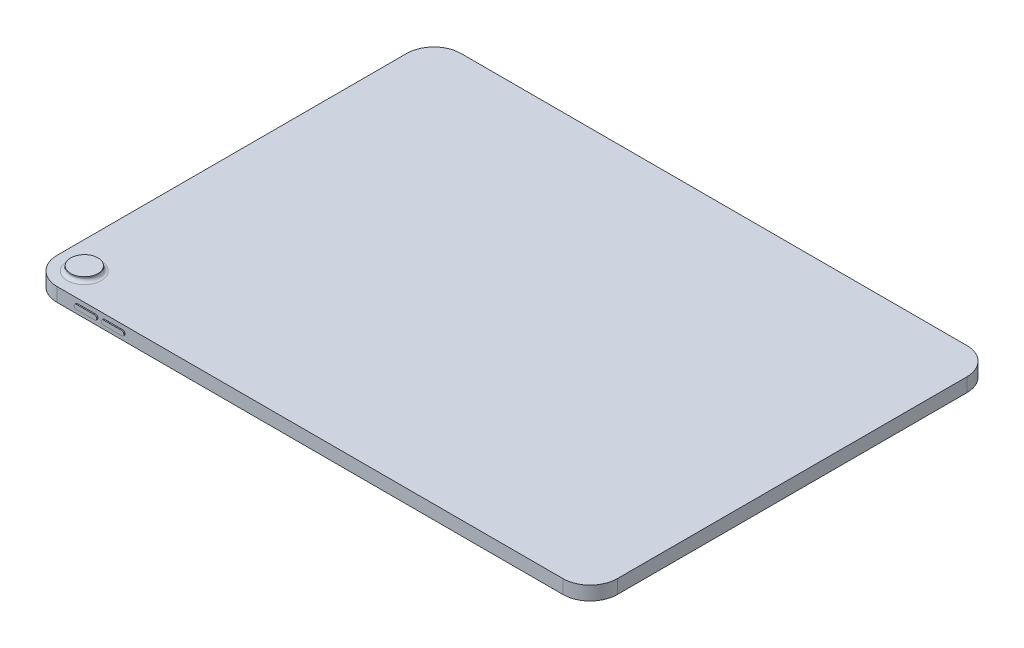
ISO-10303-21;
HEADER;
FILE_DESCRIPTION(('STEP AP214'),'2;1');
FILE_NAME('part.step','',(''),(''),'','','');
FILE_SCHEMA(('AUTOMOTIVE_DESIGN { 1 0 10303 214 1 1 1 1 }'));
ENDSEC;
DATA;
#1=APPLICATION_CONTEXT('core data for automotive mechanical design processes');
#2=APPLICATION_PROTOCOL_DEFINITION('international standard','automotive_design',2000,#1);
#3=PRODUCT_CONTEXT('',#1,'mechanical');
#4=PRODUCT('Part','Part','',(#3));
#5=PRODUCT_RELATED_PRODUCT_CATEGORY('part','',(#4));
#6=PRODUCT_DEFINITION_FORMATION('','',#4);
#7=PRODUCT_DEFINITION_CONTEXT('part definition',#1,'design');
#8=PRODUCT_DEFINITION('design','',#6,#7);
#9=PRODUCT_DEFINITION_SHAPE('','',#8);
#10=(LENGTH_UNIT() NAMED_UNIT(*) SI_UNIT(.MILLI.,.METRE.));
#11=(NAMED_UNIT(*) PLANE_ANGLE_UNIT() SI_UNIT($,.RADIAN.));
#12=(NAMED_UNIT(*) SI_UNIT($,.STERADIAN.) SOLID_ANGLE_UNIT());
#13=UNCERTAINTY_MEASURE_WITH_UNIT(LENGTH_MEASURE(1.E-05),#10,'distance_accuracy_value','');
#14=(GEOMETRIC_REPRESENTATION_CONTEXT(3) GLOBAL_UNCERTAINTY_ASSIGNED_CONTEXT((#13)) GLOBAL_UNIT_ASSIGNED_CONTEXT((#10,
#11,#12)) REPRESENTATION_CONTEXT('',''));
#15=CARTESIAN_POINT('',(0.,0.,0.));
#16=DIRECTION('',(0.,0.,1.));
#17=DIRECTION('',(1.,0.,0.));
#18=AXIS2_PLACEMENT_3D('',#15,#16,#17);
#19=CARTESIAN_POINT('',(-123.8,6.1,89.25));
#20=DIRECTION('',(0.,0.,-1.));
#21=DIRECTION('',(-1.,0.,0.));
#22=AXIS2_PLACEMENT_3D('',#19,#20,#21);
#23=PLANE('',#22);
#24=CARTESIAN_POINT('',(-82.8000000000001,3.05,89.25));
#25=DIRECTION('',(0.,0.,1.));
#26=DIRECTION('',(1.,0.,0.));
#27=AXIS2_PLACEMENT_3D('',#24,#25,#26);
#28=CIRCLE('',#27,1.);
#29=CARTESIAN_POINT('',(-82.8000000000001,2.05,89.25));
#30=VERTEX_POINT('',#29);
#31=CARTESIAN_POINT('',(-82.8000000000001,4.05,89.25));
#32=VERTEX_POINT('',#31);
#33=EDGE_CURVE('E196',#30,#32,#28,.T.);
#34=ORIENTED_EDGE('',*,*,#33,.F.);
#35=DIRECTION('',(1.,0.,0.));
#36=VECTOR('',#35,1.);
#37=CARTESIAN_POINT('',(-90.8000000000004,2.05,89.25));
#38=LINE('',#37,#36);
#39=CARTESIAN_POINT('',(-90.8000000000004,2.05,89.25));
#40=VERTEX_POINT('',#39);
#41=EDGE_CURVE('E209',#40,#30,#38,.T.);
#42=ORIENTED_EDGE('',*,*,#41,.F.);
#43=CARTESIAN_POINT('',(-90.8000000000004,3.05,89.25));
#44=DIRECTION('',(0.,0.,1.));
#45=DIRECTION('',(1.,0.,0.));
#46=AXIS2_PLACEMENT_3D('',#43,#44,#45);
#47=CIRCLE('',#46,1.);
#48=CARTESIAN_POINT('',(-90.8000000000004,4.05,89.25));
#49=VERTEX_POINT('',#48);
#50=EDGE_CURVE('E218',#49,#40,#47,.T.);
#51=ORIENTED_EDGE('',*,*,#50,.F.);
#52=DIRECTION('',(-1.,0.,0.));
#53=VECTOR('',#52,1.);
#54=CARTESIAN_POINT('',(-90.8000000000004,4.05,89.25));
#55=LINE('',#54,#53);
#56=EDGE_CURVE('E199',#32,#49,#55,.T.);
#57=ORIENTED_EDGE('',*,*,#56,.F.);
#58=EDGE_LOOP('',(#34,#42,#51,#57));
#59=FACE_BOUND('',#58,.T.);
#60=DIRECTION('',(1.,0.,0.));
#61=VECTOR('',#60,1.);
#62=CARTESIAN_POINT('',(-123.8,6.1,89.25));
#63=LINE('',#62,#61);
#64=CARTESIAN_POINT('',(-111.8,6.1,89.25));
#65=VERTEX_POINT('',#64);
#66=CARTESIAN_POINT('',(111.8,6.1,89.25));
#67=VERTEX_POINT('',#66);
#68=EDGE_CURVE('E271',#65,#67,#63,.T.);
#69=ORIENTED_EDGE('',*,*,#68,.F.);
#70=DIRECTION('',(0.,-1.,0.));
#71=VECTOR('',#70,1.);
#72=CARTESIAN_POINT('',(-111.8,6.1,89.25));
#73=LINE('',#72,#71);
#74=CARTESIAN_POINT('',(-111.8,0.,89.25));
#75=VERTEX_POINT('',#74);
#76=EDGE_CURVE('E321',#65,#75,#73,.T.);
#77=ORIENTED_EDGE('',*,*,#76,.T.);
#78=DIRECTION('',(1.,0.,0.));
#79=VECTOR('',#78,1.);
#80=CARTESIAN_POINT('',(-123.8,0.,89.25));
#81=LINE('',#80,#79);
#82=CARTESIAN_POINT('',(111.8,0.,89.25));
#83=VERTEX_POINT('',#82);
#84=EDGE_CURVE('E285',#75,#83,#81,.T.);
#85=ORIENTED_EDGE('',*,*,#84,.T.);
#86=DIRECTION('',(0.,-1.,0.));
#87=VECTOR('',#86,1.);
#88=CARTESIAN_POINT('',(111.8,6.1,89.25));
#89=LINE('',#88,#87);
#90=EDGE_CURVE('E319',#83,#67,#89,.F.);
#91=ORIENTED_EDGE('',*,*,#90,.T.);
#92=EDGE_LOOP('',(#69,#77,#85,#91));
#93=FACE_BOUND('',#92,.T.);
#94=CARTESIAN_POINT('',(-94.7999999999996,3.05,89.25));
#95=DIRECTION('',(0.,0.,1.));
#96=DIRECTION('',(1.,0.,0.));
#97=AXIS2_PLACEMENT_3D('',#94,#95,#96);
#98=CIRCLE('',#97,1.);
#99=CARTESIAN_POINT('',(-94.7999999999996,2.05,89.25));
#100=VERTEX_POINT('',#99);
#101=CARTESIAN_POINT('',(-94.7999999999996,4.05,89.25));
#102=VERTEX_POINT('',#101);
#103=EDGE_CURVE('E195',#100,#102,#98,.T.);
#104=ORIENTED_EDGE('',*,*,#103,.F.);
#105=DIRECTION('',(1.,0.,0.));
#106=VECTOR('',#105,1.);
#107=CARTESIAN_POINT('',(-102.8,2.05,89.25));
#108=LINE('',#107,#106);
#109=CARTESIAN_POINT('',(-102.8,2.05,89.25));
#110=VERTEX_POINT('',#109);
#111=EDGE_CURVE('E192',#110,#100,#108,.T.);
#112=ORIENTED_EDGE('',*,*,#111,.F.);
#113=CARTESIAN_POINT('',(-102.8,3.05,89.25));
#114=DIRECTION('',(0.,0.,1.));
#115=DIRECTION('',(1.,0.,0.));
#116=AXIS2_PLACEMENT_3D('',#113,#114,#115);
#117=CIRCLE('',#116,1.);
#118=CARTESIAN_POINT('',(-102.8,4.05,89.25));
#119=VERTEX_POINT('',#118);
#120=EDGE_CURVE('E58',#119,#110,#117,.T.);
#121=ORIENTED_EDGE('',*,*,#120,.F.);
#122=DIRECTION('',(-1.,0.,0.));
#123=VECTOR('',#122,1.);
#124=CARTESIAN_POINT('',(-102.8,4.05,89.25));
#125=LINE('',#124,#123);
#126=EDGE_CURVE('E53',#102,#119,#125,.T.);
#127=ORIENTED_EDGE('',*,*,#126,.F.);
#128=EDGE_LOOP('',(#104,#112,#121,#127));
#129=FACE_BOUND('',#128,.T.);
#130=ADVANCED_FACE('F38',(#59,#93,#129),#23,.F.);
#131=CARTESIAN_POINT('',(-123.8,6.1,-89.25));
#132=DIRECTION('',(1.,0.,0.));
#133=DIRECTION('',(0.,0.,-1.));
#134=AXIS2_PLACEMENT_3D('',#131,#132,#133);
#135=PLANE('',#134);
#136=DIRECTION('',(0.,0.,1.));
#137=VECTOR('',#136,1.);
#138=CARTESIAN_POINT('',(-123.8,6.1,-89.25));
#139=LINE('',#138,#137);
#140=CARTESIAN_POINT('',(-123.8,6.1,-77.25));
#141=VERTEX_POINT('',#140);
#142=CARTESIAN_POINT('',(-123.8,6.1,77.25));
#143=VERTEX_POINT('',#142);
#144=EDGE_CURVE('E268',#141,#143,#139,.T.);
#145=ORIENTED_EDGE('',*,*,#144,.F.);
#146=DIRECTION('',(0.,-1.,0.));
#147=VECTOR('',#146,1.);
#148=CARTESIAN_POINT('',(-123.8,6.1,-77.25));
#149=LINE('',#148,#147);
#150=CARTESIAN_POINT('',(-123.8,0.,-77.25));
#151=VERTEX_POINT('',#150);
#152=EDGE_CURVE('E295',#141,#151,#149,.T.);
#153=ORIENTED_EDGE('',*,*,#152,.T.);
#154=DIRECTION('',(0.,0.,1.));
#155=VECTOR('',#154,1.);
#156=CARTESIAN_POINT('',(-123.8,0.,-89.25));
#157=LINE('',#156,#155);
#158=CARTESIAN_POINT('',(-123.8,0.,77.25));
#159=VERTEX_POINT('',#158);
#160=EDGE_CURVE('E267',#151,#159,#157,.T.);
#161=ORIENTED_EDGE('',*,*,#160,.T.);
#162=DIRECTION('',(0.,-1.,0.));
#163=VECTOR('',#162,1.);
#164=CARTESIAN_POINT('',(-123.8,6.1,77.25));
#165=LINE('',#164,#163);
#166=EDGE_CURVE('E282',#159,#143,#165,.F.);
#167=ORIENTED_EDGE('',*,*,#166,.T.);
#168=EDGE_LOOP('',(#145,#153,#161,#167));
#169=FACE_BOUND('',#168,.T.);
#170=CARTESIAN_POINT('',(-123.8,3.05,74.4));
#171=DIRECTION('',(-1.,0.,0.));
#172=DIRECTION('',(0.,0.,1.));
#173=AXIS2_PLACEMENT_3D('',#170,#171,#172);
#174=CIRCLE('',#173,1.85);
#175=CARTESIAN_POINT('',(-123.8,1.2,74.4));
#176=VERTEX_POINT('',#175);
#177=CARTESIAN_POINT('',(-123.8,4.9,74.4));
#178=VERTEX_POINT('',#177);
#179=EDGE_CURVE('E234',#176,#178,#174,.T.);
#180=ORIENTED_EDGE('',*,*,#179,.F.);
#181=DIRECTION('',(0.,0.,-1.));
#182=VECTOR('',#181,1.);
#183=CARTESIAN_POINT('',(-123.8,1.2,74.4));
#184=LINE('',#183,#182);
#185=CARTESIAN_POINT('',(-123.8,1.2,61.1));
#186=VERTEX_POINT('',#185);
#187=EDGE_CURVE('E239',#176,#186,#184,.T.);
#188=ORIENTED_EDGE('',*,*,#187,.T.);
#189=CARTESIAN_POINT('',(-123.8,3.05,61.1));
#190=DIRECTION('',(-1.,0.,0.));
#191=DIRECTION('',(0.,0.,1.));
#192=AXIS2_PLACEMENT_3D('',#189,#190,#191);
#193=CIRCLE('',#192,1.85);
#194=CARTESIAN_POINT('',(-123.8,4.9,61.1));
#195=VERTEX_POINT('',#194);
#196=EDGE_CURVE('E251',#195,#186,#193,.T.);
#197=ORIENTED_EDGE('',*,*,#196,.F.);
#198=DIRECTION('',(0.,0.,-1.));
#199=VECTOR('',#198,1.);
#200=CARTESIAN_POINT('',(-123.8,4.9,74.4));
#201=LINE('',#200,#199);
#202=EDGE_CURVE('E249',#178,#195,#201,.T.);
#203=ORIENTED_EDGE('',*,*,#202,.F.);
#204=EDGE_LOOP('',(#180,#188,#197,#203));
#205=FACE_BOUND('',#204,.T.);
#206=ADVANCED_FACE('F349',(#169,#205),#135,.F.);
#207=CARTESIAN_POINT('',(123.8,6.1,-89.25));
#208=DIRECTION('',(-1.,0.,0.));
#209=DIRECTION('',(0.,0.,1.));
#210=AXIS2_PLACEMENT_3D('',#207,#208,#209);
#211=PLANE('',#210);
#212=DIRECTION('',(0.,0.,-1.));
#213=VECTOR('',#212,1.);
#214=CARTESIAN_POINT('',(123.8,0.,-89.25));
#215=LINE('',#214,#213);
#216=CARTESIAN_POINT('',(123.8,0.,77.25));
#217=VERTEX_POINT('',#216);
#218=CARTESIAN_POINT('',(123.8,0.,-77.25));
#219=VERTEX_POINT('',#218);
#220=EDGE_CURVE('E288',#217,#219,#215,.T.);
#221=ORIENTED_EDGE('',*,*,#220,.T.);
#222=DIRECTION('',(0.,-1.,0.));
#223=VECTOR('',#222,1.);
#224=CARTESIAN_POINT('',(123.8,6.1,-77.25));
#225=LINE('',#224,#223);
#226=CARTESIAN_POINT('',(123.8,6.1,-77.25));
#227=VERTEX_POINT('',#226);
#228=EDGE_CURVE('E327',#219,#227,#225,.F.);
#229=ORIENTED_EDGE('',*,*,#228,.T.);
#230=DIRECTION('',(0.,0.,-1.));
#231=VECTOR('',#230,1.);
#232=CARTESIAN_POINT('',(123.8,6.1,-89.25));
#233=LINE('',#232,#231);
#234=CARTESIAN_POINT('',(123.8,6.1,77.25));
#235=VERTEX_POINT('',#234);
#236=EDGE_CURVE('E275',#235,#227,#233,.T.);
#237=ORIENTED_EDGE('',*,*,#236,.F.);
#238=DIRECTION('',(0.,-1.,0.));
#239=VECTOR('',#238,1.);
#240=CARTESIAN_POINT('',(123.8,6.1,77.25));
#241=LINE('',#240,#239);
#242=EDGE_CURVE('E324',#235,#217,#241,.T.);
#243=ORIENTED_EDGE('',*,*,#242,.T.);
#244=EDGE_LOOP('',(#221,#229,#237,#243));
#245=FACE_BOUND('',#244,.T.);
#246=ADVANCED_FACE('F355',(#245),#211,.F.);
#247=CARTESIAN_POINT('',(-123.8,6.1,-89.25));
#248=DIRECTION('',(0.,0.,1.));
#249=DIRECTION('',(1.,0.,0.));
#250=AXIS2_PLACEMENT_3D('',#247,#248,#249);
#251=PLANE('',#250);
#252=DIRECTION('',(-1.,0.,0.));
#253=VECTOR('',#252,1.);
#254=CARTESIAN_POINT('',(-123.8,0.,-89.25));
#255=LINE('',#254,#253);
#256=CARTESIAN_POINT('',(111.8,0.,-89.25));
#257=VERTEX_POINT('',#256);
#258=CARTESIAN_POINT('',(-111.8,0.,-89.25));
#259=VERTEX_POINT('',#258);
#260=EDGE_CURVE('E272',#257,#259,#255,.T.);
#261=ORIENTED_EDGE('',*,*,#260,.T.);
#262=DIRECTION('',(0.,-1.,0.));
#263=VECTOR('',#262,1.);
#264=CARTESIAN_POINT('',(-111.8,6.1,-89.25));
#265=LINE('',#264,#263);
#266=CARTESIAN_POINT('',(-111.8,6.1,-89.25));
#267=VERTEX_POINT('',#266);
#268=EDGE_CURVE('E309',#259,#267,#265,.F.);
#269=ORIENTED_EDGE('',*,*,#268,.T.);
#270=DIRECTION('',(-1.,0.,0.));
#271=VECTOR('',#270,1.);
#272=CARTESIAN_POINT('',(-123.8,6.1,-89.25));
#273=LINE('',#272,#271);
#274=CARTESIAN_POINT('',(111.8,6.1,-89.25));
#275=VERTEX_POINT('',#274);
#276=EDGE_CURVE('E279',#275,#267,#273,.T.);
#277=ORIENTED_EDGE('',*,*,#276,.F.);
#278=DIRECTION('',(0.,-1.,0.));
#279=VECTOR('',#278,1.);
#280=CARTESIAN_POINT('',(111.8,6.1,-89.25));
#281=LINE('',#280,#279);
#282=EDGE_CURVE('E306',#275,#257,#281,.T.);
#283=ORIENTED_EDGE('',*,*,#282,.T.);
#284=EDGE_LOOP('',(#261,#269,#277,#283));
#285=FACE_BOUND('',#284,.T.);
#286=ADVANCED_FACE('F396',(#285),#251,.F.);
#287=CARTESIAN_POINT('',(0.,6.1,0.));
#288=DIRECTION('',(0.,1.,0.));
#289=DIRECTION('',(0.,0.,1.));
#290=AXIS2_PLACEMENT_3D('',#287,#288,#289);
#291=PLANE('',#290);
#292=CARTESIAN_POINT('',(-111.8,6.1,77.25));
#293=DIRECTION('',(0.,1.,0.));
#294=DIRECTION('',(0.,0.,1.));
#295=AXIS2_PLACEMENT_3D('',#292,#293,#294);
#296=CIRCLE('',#295,7.5);
#297=CARTESIAN_POINT('',(-111.8,6.1,84.75));
#298=VERTEX_POINT('',#297);
#299=EDGE_CURVE('E11',#298,#298,#296,.F.);
#300=ORIENTED_EDGE('',*,*,#299,.T.);
#301=EDGE_LOOP('',(#300));
#302=FACE_BOUND('',#301,.T.);
#303=ORIENTED_EDGE('',*,*,#276,.T.);
#304=CARTESIAN_POINT('',(-111.8,6.1,-77.25));
#305=DIRECTION('',(0.,1.,0.));
#306=DIRECTION('',(0.,0.,1.));
#307=AXIS2_PLACEMENT_3D('',#304,#305,#306);
#308=CIRCLE('',#307,12.);
#309=EDGE_CURVE('E317',#267,#141,#308,.T.);
#310=ORIENTED_EDGE('',*,*,#309,.T.);
#311=ORIENTED_EDGE('',*,*,#144,.T.);
#312=CARTESIAN_POINT('',(-111.8,6.1,77.25));
#313=DIRECTION('',(0.,1.,0.));
#314=DIRECTION('',(0.,0.,1.));
#315=AXIS2_PLACEMENT_3D('',#312,#313,#314);
#316=CIRCLE('',#315,12.);
#317=EDGE_CURVE('E315',#143,#65,#316,.T.);
#318=ORIENTED_EDGE('',*,*,#317,.T.);
#319=ORIENTED_EDGE('',*,*,#68,.T.);
#320=CARTESIAN_POINT('',(111.8,6.1,77.25));
#321=DIRECTION('',(0.,1.,0.));
#322=DIRECTION('',(0.,0.,1.));
#323=AXIS2_PLACEMENT_3D('',#320,#321,#322);
#324=CIRCLE('',#323,12.);
#325=EDGE_CURVE('E311',#67,#235,#324,.T.);
#326=ORIENTED_EDGE('',*,*,#325,.T.);
#327=ORIENTED_EDGE('',*,*,#236,.T.);
#328=CARTESIAN_POINT('',(111.8,6.1,-77.25));
#329=DIRECTION('',(0.,1.,0.));
#330=DIRECTION('',(0.,0.,1.));
#331=AXIS2_PLACEMENT_3D('',#328,#329,#330);
#332=CIRCLE('',#331,12.);
#333=EDGE_CURVE('E313',#227,#275,#332,.T.);
#334=ORIENTED_EDGE('',*,*,#333,.T.);
#335=EDGE_LOOP('',(#303,#310,#311,#318,#319,#326,#327,#334));
#336=FACE_BOUND('',#335,.T.);
#337=ADVANCED_FACE('F386',(#302,#336),#291,.T.);
#338=CARTESIAN_POINT('',(0.,0.,0.));
#339=DIRECTION('',(0.,1.,0.));
#340=DIRECTION('',(0.,0.,1.));
#341=AXIS2_PLACEMENT_3D('',#338,#339,#340);
#342=PLANE('',#341);
#343=ORIENTED_EDGE('',*,*,#160,.F.);
#344=CARTESIAN_POINT('',(-111.8,0.,-77.25));
#345=DIRECTION('',(0.,1.,0.));
#346=DIRECTION('',(0.,0.,1.));
#347=AXIS2_PLACEMENT_3D('',#344,#345,#346);
#348=CIRCLE('',#347,12.);
#349=EDGE_CURVE('E304',#151,#259,#348,.F.);
#350=ORIENTED_EDGE('',*,*,#349,.T.);
#351=ORIENTED_EDGE('',*,*,#260,.F.);
#352=CARTESIAN_POINT('',(111.8,0.,-77.25));
#353=DIRECTION('',(0.,1.,0.));
#354=DIRECTION('',(0.,0.,1.));
#355=AXIS2_PLACEMENT_3D('',#352,#353,#354);
#356=CIRCLE('',#355,12.);
#357=EDGE_CURVE('E300',#257,#219,#356,.F.);
#358=ORIENTED_EDGE('',*,*,#357,.T.);
#359=ORIENTED_EDGE('',*,*,#220,.F.);
#360=CARTESIAN_POINT('',(111.8,0.,77.25));
#361=DIRECTION('',(0.,1.,0.));
#362=DIRECTION('',(0.,0.,1.));
#363=AXIS2_PLACEMENT_3D('',#360,#361,#362);
#364=CIRCLE('',#363,12.);
#365=EDGE_CURVE('E298',#217,#83,#364,.F.);
#366=ORIENTED_EDGE('',*,*,#365,.T.);
#367=ORIENTED_EDGE('',*,*,#84,.F.);
#368=CARTESIAN_POINT('',(-111.8,0.,77.25));
#369=DIRECTION('',(0.,1.,0.));
#370=DIRECTION('',(0.,0.,1.));
#371=AXIS2_PLACEMENT_3D('',#368,#369,#370);
#372=CIRCLE('',#371,12.);
#373=EDGE_CURVE('E302',#75,#159,#372,.F.);
#374=ORIENTED_EDGE('',*,*,#373,.T.);
#375=EDGE_LOOP('',(#343,#350,#351,#358,#359,#366,#367,#374));
#376=FACE_BOUND('',#375,.T.);
#377=ADVANCED_FACE('F366',(#376),#342,.F.);
#378=CARTESIAN_POINT('',(-111.8,6.1,-77.25));
#379=DIRECTION('',(0.,-1.,0.));
#380=DIRECTION('',(0.,0.,-1.));
#381=AXIS2_PLACEMENT_3D('',#378,#379,#380);
#382=CYLINDRICAL_SURFACE('',#381,12.);
#383=ORIENTED_EDGE('',*,*,#309,.F.);
#384=ORIENTED_EDGE('',*,*,#268,.F.);
#385=ORIENTED_EDGE('',*,*,#349,.F.);
#386=ORIENTED_EDGE('',*,*,#152,.F.);
#387=EDGE_LOOP('',(#383,#384,#385,#386));
#388=FACE_BOUND('',#387,.T.);
#389=ADVANCED_FACE('F362',(#388),#382,.T.);
#390=CARTESIAN_POINT('',(-111.8,6.1,77.25));
#391=DIRECTION('',(0.,-1.,0.));
#392=DIRECTION('',(0.,0.,-1.));
#393=AXIS2_PLACEMENT_3D('',#390,#391,#392);
#394=CYLINDRICAL_SURFACE('',#393,12.);
#395=ORIENTED_EDGE('',*,*,#317,.F.);
#396=ORIENTED_EDGE('',*,*,#166,.F.);
#397=ORIENTED_EDGE('',*,*,#373,.F.);
#398=ORIENTED_EDGE('',*,*,#76,.F.);
#399=EDGE_LOOP('',(#395,#396,#397,#398));
#400=FACE_BOUND('',#399,.T.);
#401=ADVANCED_FACE('F365',(#400),#394,.T.);
#402=CARTESIAN_POINT('',(111.8,6.1,-77.25));
#403=DIRECTION('',(0.,-1.,0.));
#404=DIRECTION('',(0.,0.,-1.));
#405=AXIS2_PLACEMENT_3D('',#402,#403,#404);
#406=CYLINDRICAL_SURFACE('',#405,12.);
#407=ORIENTED_EDGE('',*,*,#333,.F.);
#408=ORIENTED_EDGE('',*,*,#228,.F.);
#409=ORIENTED_EDGE('',*,*,#357,.F.);
#410=ORIENTED_EDGE('',*,*,#282,.F.);
#411=EDGE_LOOP('',(#407,#408,#409,#410));
#412=FACE_BOUND('',#411,.T.);
#413=ADVANCED_FACE('F370',(#412),#406,.T.);
#414=CARTESIAN_POINT('',(111.8,6.1,77.25));
#415=DIRECTION('',(0.,-1.,0.));
#416=DIRECTION('',(0.,0.,-1.));
#417=AXIS2_PLACEMENT_3D('',#414,#415,#416);
#418=CYLINDRICAL_SURFACE('',#417,12.);
#419=ORIENTED_EDGE('',*,*,#325,.F.);
#420=ORIENTED_EDGE('',*,*,#90,.F.);
#421=ORIENTED_EDGE('',*,*,#365,.F.);
#422=ORIENTED_EDGE('',*,*,#242,.F.);
#423=EDGE_LOOP('',(#419,#420,#421,#422));
#424=FACE_BOUND('',#423,.T.);
#425=ADVANCED_FACE('F373',(#424),#418,.T.);
#426=CARTESIAN_POINT('',(-111.8,8.1,77.25));
#427=DIRECTION('',(0.,-1.,0.));
#428=DIRECTION('',(0.,0.,-1.));
#429=AXIS2_PLACEMENT_3D('',#426,#427,#428);
#430=CYLINDRICAL_SURFACE('',#429,6.);
#431=CARTESIAN_POINT('',(-111.8,7.6,77.25));
#432=DIRECTION('',(0.,1.,0.));
#433=DIRECTION('',(0.,0.,1.));
#434=AXIS2_PLACEMENT_3D('',#431,#432,#433);
#435=CIRCLE('',#434,6.);
#436=CARTESIAN_POINT('',(-111.8,7.6,83.25));
#437=VERTEX_POINT('',#436);
#438=EDGE_CURVE('E46',#437,#437,#435,.T.);
#439=ORIENTED_EDGE('',*,*,#438,.T.);
#440=EDGE_LOOP('',(#439));
#441=FACE_BOUND('',#440,.T.);
#442=CARTESIAN_POINT('',(-111.8,8.1,77.25));
#443=DIRECTION('',(0.,1.,0.));
#444=DIRECTION('',(0.,0.,1.));
#445=AXIS2_PLACEMENT_3D('',#442,#443,#444);
#446=CIRCLE('',#445,6.);
#447=CARTESIAN_POINT('',(-111.8,8.1,83.25));
#448=VERTEX_POINT('',#447);
#449=EDGE_CURVE('E264',#448,#448,#446,.T.);
#450=ORIENTED_EDGE('',*,*,#449,.F.);
#451=EDGE_LOOP('',(#450));
#452=FACE_BOUND('',#451,.T.);
#453=ADVANCED_FACE('F331',(#441,#452),#430,.T.);
#454=CARTESIAN_POINT('',(-111.8,8.1,77.25));
#455=DIRECTION('',(0.,1.,0.));
#456=DIRECTION('',(0.,0.,1.));
#457=AXIS2_PLACEMENT_3D('',#454,#455,#456);
#458=PLANE('',#457);
#459=ORIENTED_EDGE('',*,*,#449,.T.);
#460=EDGE_LOOP('',(#459));
#461=FACE_BOUND('',#460,.T.);
#462=ADVANCED_FACE('F336',(#461),#458,.T.);
#463=CARTESIAN_POINT('',(-111.8,7.6,77.25));
#464=DIRECTION('',(0.,1.,0.));
#465=DIRECTION('',(0.,0.,1.));
#466=AXIS2_PLACEMENT_3D('',#463,#464,#465);
#467=TOROIDAL_SURFACE('',#466,7.5,1.5);
#468=ORIENTED_EDGE('',*,*,#299,.F.);
#469=EDGE_LOOP('',(#468));
#470=FACE_BOUND('',#469,.T.);
#471=ORIENTED_EDGE('',*,*,#438,.F.);
#472=EDGE_LOOP('',(#471));
#473=FACE_BOUND('',#472,.T.);
#474=ADVANCED_FACE('F40',(#470,#473),#467,.F.);
#475=CARTESIAN_POINT('',(-124.3,3.05,74.4));
#476=DIRECTION('',(1.,0.,0.));
#477=DIRECTION('',(0.,0.,-1.));
#478=AXIS2_PLACEMENT_3D('',#475,#476,#477);
#479=CYLINDRICAL_SURFACE('',#478,1.85);
#480=ORIENTED_EDGE('',*,*,#179,.T.);
#481=DIRECTION('',(1.,0.,0.));
#482=VECTOR('',#481,1.);
#483=CARTESIAN_POINT('',(-124.3,4.9,74.4));
#484=LINE('',#483,#482);
#485=CARTESIAN_POINT('',(-124.3,4.9,74.4));
#486=VERTEX_POINT('',#485);
#487=EDGE_CURVE('E262',#486,#178,#484,.T.);
#488=ORIENTED_EDGE('',*,*,#487,.F.);
#489=CARTESIAN_POINT('',(-124.3,3.05,74.4));
#490=DIRECTION('',(-1.,0.,0.));
#491=DIRECTION('',(0.,0.,1.));
#492=AXIS2_PLACEMENT_3D('',#489,#490,#491);
#493=CIRCLE('',#492,1.85);
#494=CARTESIAN_POINT('',(-124.3,1.2,74.4));
#495=VERTEX_POINT('',#494);
#496=EDGE_CURVE('E235',#495,#486,#493,.T.);
#497=ORIENTED_EDGE('',*,*,#496,.F.);
#498=DIRECTION('',(1.,0.,0.));
#499=VECTOR('',#498,1.);
#500=CARTESIAN_POINT('',(-124.3,1.2,74.4));
#501=LINE('',#500,#499);
#502=EDGE_CURVE('E246',#495,#176,#501,.T.);
#503=ORIENTED_EDGE('',*,*,#502,.T.);
#504=EDGE_LOOP('',(#480,#488,#497,#503));
#505=FACE_BOUND('',#504,.T.);
#506=ADVANCED_FACE('F335',(#505),#479,.T.);
#507=CARTESIAN_POINT('',(-124.3,4.9,74.4));
#508=DIRECTION('',(0.,-1.,0.));
#509=DIRECTION('',(0.,0.,-1.));
#510=AXIS2_PLACEMENT_3D('',#507,#508,#509);
#511=PLANE('',#510);
#512=ORIENTED_EDGE('',*,*,#202,.T.);
#513=DIRECTION('',(1.,0.,0.));
#514=VECTOR('',#513,1.);
#515=CARTESIAN_POINT('',(-124.3,4.9,61.1));
#516=LINE('',#515,#514);
#517=CARTESIAN_POINT('',(-124.3,4.9,61.1));
#518=VERTEX_POINT('',#517);
#519=EDGE_CURVE('E259',#518,#195,#516,.T.);
#520=ORIENTED_EDGE('',*,*,#519,.F.);
#521=DIRECTION('',(0.,0.,-1.));
#522=VECTOR('',#521,1.);
#523=CARTESIAN_POINT('',(-124.3,4.9,74.4));
#524=LINE('',#523,#522);
#525=EDGE_CURVE('E238',#486,#518,#524,.T.);
#526=ORIENTED_EDGE('',*,*,#525,.F.);
#527=ORIENTED_EDGE('',*,*,#487,.T.);
#528=EDGE_LOOP('',(#512,#520,#526,#527));
#529=FACE_BOUND('',#528,.T.);
#530=ADVANCED_FACE('F342',(#529),#511,.F.);
#531=CARTESIAN_POINT('',(-124.3,3.05,61.1));
#532=DIRECTION('',(1.,0.,0.));
#533=DIRECTION('',(0.,0.,-1.));
#534=AXIS2_PLACEMENT_3D('',#531,#532,#533);
#535=CYLINDRICAL_SURFACE('',#534,1.85);
#536=ORIENTED_EDGE('',*,*,#196,.T.);
#537=DIRECTION('',(1.,0.,0.));
#538=VECTOR('',#537,1.);
#539=CARTESIAN_POINT('',(-124.3,1.2,61.1));
#540=LINE('',#539,#538);
#541=CARTESIAN_POINT('',(-124.3,1.2,61.1));
#542=VERTEX_POINT('',#541);
#543=EDGE_CURVE('E256',#542,#186,#540,.T.);
#544=ORIENTED_EDGE('',*,*,#543,.F.);
#545=CARTESIAN_POINT('',(-124.3,3.05,61.1));
#546=DIRECTION('',(-1.,0.,0.));
#547=DIRECTION('',(0.,0.,1.));
#548=AXIS2_PLACEMENT_3D('',#545,#546,#547);
#549=CIRCLE('',#548,1.85);
#550=EDGE_CURVE('E241',#518,#542,#549,.T.);
#551=ORIENTED_EDGE('',*,*,#550,.F.);
#552=ORIENTED_EDGE('',*,*,#519,.T.);
#553=EDGE_LOOP('',(#536,#544,#551,#552));
#554=FACE_BOUND('',#553,.T.);
#555=ADVANCED_FACE('F443',(#554),#535,.T.);
#556=CARTESIAN_POINT('',(-124.3,1.2,74.4));
#557=DIRECTION('',(0.,-1.,0.));
#558=DIRECTION('',(0.,0.,-1.));
#559=AXIS2_PLACEMENT_3D('',#556,#557,#558);
#560=PLANE('',#559);
#561=ORIENTED_EDGE('',*,*,#187,.F.);
#562=ORIENTED_EDGE('',*,*,#502,.F.);
#563=DIRECTION('',(0.,0.,-1.));
#564=VECTOR('',#563,1.);
#565=CARTESIAN_POINT('',(-124.3,1.2,74.4));
#566=LINE('',#565,#564);
#567=EDGE_CURVE('E243',#495,#542,#566,.T.);
#568=ORIENTED_EDGE('',*,*,#567,.T.);
#569=ORIENTED_EDGE('',*,*,#543,.T.);
#570=EDGE_LOOP('',(#561,#562,#568,#569));
#571=FACE_BOUND('',#570,.T.);
#572=ADVANCED_FACE('F453',(#571),#560,.T.);
#573=CARTESIAN_POINT('',(-124.3,3.05,74.4));
#574=DIRECTION('',(-1.,0.,0.));
#575=DIRECTION('',(0.,0.,1.));
#576=AXIS2_PLACEMENT_3D('',#573,#574,#575);
#577=PLANE('',#576);
#578=ORIENTED_EDGE('',*,*,#496,.T.);
#579=ORIENTED_EDGE('',*,*,#525,.T.);
#580=ORIENTED_EDGE('',*,*,#550,.T.);
#581=ORIENTED_EDGE('',*,*,#567,.F.);
#582=EDGE_LOOP('',(#578,#579,#580,#581));
#583=FACE_BOUND('',#582,.T.);
#584=ADVANCED_FACE('F463',(#583),#577,.T.);
#585=CARTESIAN_POINT('',(-82.8000000000001,3.05,89.75));
#586=DIRECTION('',(0.,0.,-1.));
#587=DIRECTION('',(-1.,0.,0.));
#588=AXIS2_PLACEMENT_3D('',#585,#586,#587);
#589=CYLINDRICAL_SURFACE('',#588,1.);
#590=ORIENTED_EDGE('',*,*,#33,.T.);
#591=DIRECTION('',(0.,0.,-1.));
#592=VECTOR('',#591,1.);
#593=CARTESIAN_POINT('',(-82.8000000000001,4.05,89.75));
#594=LINE('',#593,#592);
#595=CARTESIAN_POINT('',(-82.8000000000001,4.05,89.75));
#596=VERTEX_POINT('',#595);
#597=EDGE_CURVE('E231',#596,#32,#594,.T.);
#598=ORIENTED_EDGE('',*,*,#597,.F.);
#599=CARTESIAN_POINT('',(-82.8000000000001,3.05,89.75));
#600=DIRECTION('',(0.,0.,1.));
#601=DIRECTION('',(1.,0.,0.));
#602=AXIS2_PLACEMENT_3D('',#599,#600,#601);
#603=CIRCLE('',#602,1.);
#604=CARTESIAN_POINT('',(-82.8000000000001,2.05,89.75));
#605=VERTEX_POINT('',#604);
#606=EDGE_CURVE('E205',#605,#596,#603,.T.);
#607=ORIENTED_EDGE('',*,*,#606,.F.);
#608=DIRECTION('',(0.,0.,-1.));
#609=VECTOR('',#608,1.);
#610=CARTESIAN_POINT('',(-82.8000000000001,2.05,89.75));
#611=LINE('',#610,#609);
#612=EDGE_CURVE('E214',#605,#30,#611,.T.);
#613=ORIENTED_EDGE('',*,*,#612,.T.);
#614=EDGE_LOOP('',(#590,#598,#607,#613));
#615=FACE_BOUND('',#614,.T.);
#616=ADVANCED_FACE('F472',(#615),#589,.T.);
#617=CARTESIAN_POINT('',(-90.8000000000004,4.05,89.75));
#618=DIRECTION('',(0.,-1.,0.));
#619=DIRECTION('',(1.,0.,0.));
#620=AXIS2_PLACEMENT_3D('',#617,#618,#619);
#621=PLANE('',#620);
#622=ORIENTED_EDGE('',*,*,#56,.T.);
#623=DIRECTION('',(0.,0.,-1.));
#624=VECTOR('',#623,1.);
#625=CARTESIAN_POINT('',(-90.8000000000004,4.05,89.75));
#626=LINE('',#625,#624);
#627=CARTESIAN_POINT('',(-90.8000000000004,4.05,89.75));
#628=VERTEX_POINT('',#627);
#629=EDGE_CURVE('E228',#628,#49,#626,.T.);
#630=ORIENTED_EDGE('',*,*,#629,.F.);
#631=DIRECTION('',(-1.,0.,0.));
#632=VECTOR('',#631,1.);
#633=CARTESIAN_POINT('',(-90.8000000000004,4.05,89.75));
#634=LINE('',#633,#632);
#635=EDGE_CURVE('E208',#596,#628,#634,.T.);
#636=ORIENTED_EDGE('',*,*,#635,.F.);
#637=ORIENTED_EDGE('',*,*,#597,.T.);
#638=EDGE_LOOP('',(#622,#630,#636,#637));
#639=FACE_BOUND('',#638,.T.);
#640=ADVANCED_FACE('F487',(#639),#621,.F.);
#641=CARTESIAN_POINT('',(-90.8000000000004,3.05,89.75));
#642=DIRECTION('',(0.,0.,-1.));
#643=DIRECTION('',(-1.,0.,0.));
#644=AXIS2_PLACEMENT_3D('',#641,#642,#643);
#645=CYLINDRICAL_SURFACE('',#644,1.);
#646=ORIENTED_EDGE('',*,*,#50,.T.);
#647=DIRECTION('',(0.,0.,-1.));
#648=VECTOR('',#647,1.);
#649=CARTESIAN_POINT('',(-90.8000000000004,2.05,89.75));
#650=LINE('',#649,#648);
#651=CARTESIAN_POINT('',(-90.8000000000004,2.05,89.75));
#652=VERTEX_POINT('',#651);
#653=EDGE_CURVE('E225',#652,#40,#650,.T.);
#654=ORIENTED_EDGE('',*,*,#653,.F.);
#655=CARTESIAN_POINT('',(-90.8000000000004,3.05,89.75));
#656=DIRECTION('',(0.,0.,1.));
#657=DIRECTION('',(1.,0.,0.));
#658=AXIS2_PLACEMENT_3D('',#655,#656,#657);
#659=CIRCLE('',#658,1.);
#660=EDGE_CURVE('E211',#628,#652,#659,.T.);
#661=ORIENTED_EDGE('',*,*,#660,.F.);
#662=ORIENTED_EDGE('',*,*,#629,.T.);
#663=EDGE_LOOP('',(#646,#654,#661,#662));
#664=FACE_BOUND('',#663,.T.);
#665=ADVANCED_FACE('F497',(#664),#645,.T.);
#666=CARTESIAN_POINT('',(-90.8000000000004,2.05,89.75));
#667=DIRECTION('',(0.,1.,0.));
#668=DIRECTION('',(-1.,0.,0.));
#669=AXIS2_PLACEMENT_3D('',#666,#667,#668);
#670=PLANE('',#669);
#671=ORIENTED_EDGE('',*,*,#41,.T.);
#672=ORIENTED_EDGE('',*,*,#612,.F.);
#673=DIRECTION('',(1.,0.,0.));
#674=VECTOR('',#673,1.);
#675=CARTESIAN_POINT('',(-90.8000000000004,2.05,89.75));
#676=LINE('',#675,#674);
#677=EDGE_CURVE('E213',#652,#605,#676,.T.);
#678=ORIENTED_EDGE('',*,*,#677,.F.);
#679=ORIENTED_EDGE('',*,*,#653,.T.);
#680=EDGE_LOOP('',(#671,#672,#678,#679));
#681=FACE_BOUND('',#680,.T.);
#682=ADVANCED_FACE('F507',(#681),#670,.F.);
#683=CARTESIAN_POINT('',(-82.8000000000001,3.05,89.75));
#684=DIRECTION('',(0.,0.,1.));
#685=DIRECTION('',(1.,0.,0.));
#686=AXIS2_PLACEMENT_3D('',#683,#684,#685);
#687=PLANE('',#686);
#688=ORIENTED_EDGE('',*,*,#606,.T.);
#689=ORIENTED_EDGE('',*,*,#635,.T.);
#690=ORIENTED_EDGE('',*,*,#660,.T.);
#691=ORIENTED_EDGE('',*,*,#677,.T.);
#692=EDGE_LOOP('',(#688,#689,#690,#691));
#693=FACE_BOUND('',#692,.T.);
#694=ADVANCED_FACE('F517',(#693),#687,.T.);
#695=CARTESIAN_POINT('',(-94.7999999999996,3.05,89.75));
#696=DIRECTION('',(0.,0.,-1.));
#697=DIRECTION('',(-1.,0.,0.));
#698=AXIS2_PLACEMENT_3D('',#695,#696,#697);
#699=CYLINDRICAL_SURFACE('',#698,1.);
#700=ORIENTED_EDGE('',*,*,#103,.T.);
#701=DIRECTION('',(0.,0.,-1.));
#702=VECTOR('',#701,1.);
#703=CARTESIAN_POINT('',(-94.7999999999996,4.05,89.75));
#704=LINE('',#703,#702);
#705=CARTESIAN_POINT('',(-94.7999999999996,4.05,89.75));
#706=VERTEX_POINT('',#705);
#707=EDGE_CURVE('E176',#706,#102,#704,.T.);
#708=ORIENTED_EDGE('',*,*,#707,.F.);
#709=CARTESIAN_POINT('',(-94.7999999999996,3.05,89.75));
#710=DIRECTION('',(0.,0.,1.));
#711=DIRECTION('',(1.,0.,0.));
#712=AXIS2_PLACEMENT_3D('',#709,#710,#711);
#713=CIRCLE('',#712,1.);
#714=CARTESIAN_POINT('',(-94.7999999999996,2.05,89.75));
#715=VERTEX_POINT('',#714);
#716=EDGE_CURVE('E183',#715,#706,#713,.T.);
#717=ORIENTED_EDGE('',*,*,#716,.F.);
#718=DIRECTION('',(0.,0.,-1.));
#719=VECTOR('',#718,1.);
#720=CARTESIAN_POINT('',(-94.7999999999996,2.05,89.75));
#721=LINE('',#720,#719);
#722=EDGE_CURVE('E577',#715,#100,#721,.T.);
#723=ORIENTED_EDGE('',*,*,#722,.T.);
#724=EDGE_LOOP('',(#700,#708,#717,#723));
#725=FACE_BOUND('',#724,.T.);
#726=ADVANCED_FACE('F194',(#725),#699,.T.);
#727=CARTESIAN_POINT('',(-102.8,4.05,89.75));
#728=DIRECTION('',(0.,-1.,0.));
#729=DIRECTION('',(1.,0.,0.));
#730=AXIS2_PLACEMENT_3D('',#727,#728,#729);
#731=PLANE('',#730);
#732=ORIENTED_EDGE('',*,*,#126,.T.);
#733=DIRECTION('',(0.,0.,-1.));
#734=VECTOR('',#733,1.);
#735=CARTESIAN_POINT('',(-102.8,4.05,89.75));
#736=LINE('',#735,#734);
#737=CARTESIAN_POINT('',(-102.8,4.05,89.75));
#738=VERTEX_POINT('',#737);
#739=EDGE_CURVE('E179',#738,#119,#736,.T.);
#740=ORIENTED_EDGE('',*,*,#739,.F.);
#741=DIRECTION('',(-1.,0.,0.));
#742=VECTOR('',#741,1.);
#743=CARTESIAN_POINT('',(-102.8,4.05,89.75));
#744=LINE('',#743,#742);
#745=EDGE_CURVE('E172',#706,#738,#744,.T.);
#746=ORIENTED_EDGE('',*,*,#745,.F.);
#747=ORIENTED_EDGE('',*,*,#707,.T.);
#748=EDGE_LOOP('',(#732,#740,#746,#747));
#749=FACE_BOUND('',#748,.T.);
#750=ADVANCED_FACE('F174',(#749),#731,.F.);
#751=CARTESIAN_POINT('',(-102.8,3.05,89.75));
#752=DIRECTION('',(0.,0.,-1.));
#753=DIRECTION('',(-1.,0.,0.));
#754=AXIS2_PLACEMENT_3D('',#751,#752,#753);
#755=CYLINDRICAL_SURFACE('',#754,1.);
#756=ORIENTED_EDGE('',*,*,#120,.T.);
#757=DIRECTION('',(0.,0.,-1.));
#758=VECTOR('',#757,1.);
#759=CARTESIAN_POINT('',(-102.8,2.05,89.75));
#760=LINE('',#759,#758);
#761=CARTESIAN_POINT('',(-102.8,2.05,89.75));
#762=VERTEX_POINT('',#761);
#763=EDGE_CURVE('E201',#762,#110,#760,.T.);
#764=ORIENTED_EDGE('',*,*,#763,.F.);
#765=CARTESIAN_POINT('',(-102.8,3.05,89.75));
#766=DIRECTION('',(0.,0.,1.));
#767=DIRECTION('',(1.,0.,0.));
#768=AXIS2_PLACEMENT_3D('',#765,#766,#767);
#769=CIRCLE('',#768,1.);
#770=EDGE_CURVE('E182',#738,#762,#769,.T.);
#771=ORIENTED_EDGE('',*,*,#770,.F.);
#772=ORIENTED_EDGE('',*,*,#739,.T.);
#773=EDGE_LOOP('',(#756,#764,#771,#772));
#774=FACE_BOUND('',#773,.T.);
#775=ADVANCED_FACE('F544',(#774),#755,.T.);
#776=CARTESIAN_POINT('',(-102.8,2.05,89.75));
#777=DIRECTION('',(0.,1.,0.));
#778=DIRECTION('',(-1.,0.,0.));
#779=AXIS2_PLACEMENT_3D('',#776,#777,#778);
#780=PLANE('',#779);
#781=ORIENTED_EDGE('',*,*,#111,.T.);
#782=ORIENTED_EDGE('',*,*,#722,.F.);
#783=DIRECTION('',(1.,0.,0.));
#784=VECTOR('',#783,1.);
#785=CARTESIAN_POINT('',(-102.8,2.05,89.75));
#786=LINE('',#785,#784);
#787=EDGE_CURVE('E188',#762,#715,#786,.T.);
#788=ORIENTED_EDGE('',*,*,#787,.F.);
#789=ORIENTED_EDGE('',*,*,#763,.T.);
#790=EDGE_LOOP('',(#781,#782,#788,#789));
#791=FACE_BOUND('',#790,.T.);
#792=ADVANCED_FACE('F553',(#791),#780,.F.);
#793=CARTESIAN_POINT('',(-94.7999999999996,3.05,89.75));
#794=DIRECTION('',(0.,0.,1.));
#795=DIRECTION('',(1.,0.,0.));
#796=AXIS2_PLACEMENT_3D('',#793,#794,#795);
#797=PLANE('',#796);
#798=ORIENTED_EDGE('',*,*,#716,.T.);
#799=ORIENTED_EDGE('',*,*,#745,.T.);
#800=ORIENTED_EDGE('',*,*,#770,.T.);
#801=ORIENTED_EDGE('',*,*,#787,.T.);
#802=EDGE_LOOP('',(#798,#799,#800,#801));
#803=FACE_BOUND('',#802,.T.);
#804=ADVANCED_FACE('F186',(#803),#797,.T.);
#805=CLOSED_SHELL('',(#130,#206,#246,#286,#337,#377,#389,#401,#413,#425,#453,#462,#474,#506,
#530,#555,#572,#584,#616,#640,#665,#682,#694,#726,#750,#775,#792,#804));
#806=MANIFOLD_SOLID_BREP('B2',#805);
#807=ADVANCED_BREP_SHAPE_REPRESENTATION('',(#18,#806),#14);
#808=SHAPE_DEFINITION_REPRESENTATION(#9,#807);
ENDSEC;
END-ISO-10303-21;
